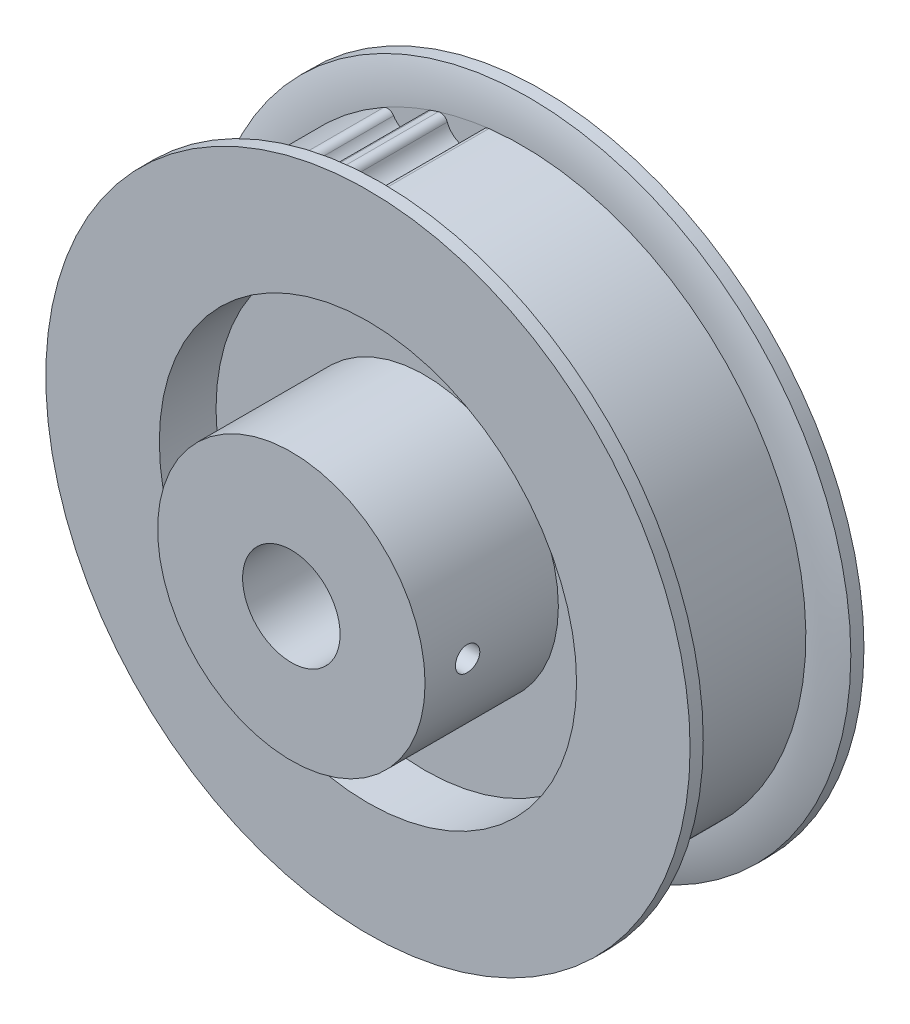
ISO-10303-21;
HEADER;
FILE_DESCRIPTION(('STEP AP214'),'2;1');
FILE_NAME('part.step','',(''),(''),'','','');
FILE_SCHEMA(('AUTOMOTIVE_DESIGN { 1 0 10303 214 1 1 1 1 }'));
ENDSEC;
DATA;
#1=APPLICATION_CONTEXT('core data for automotive mechanical design processes');
#2=APPLICATION_PROTOCOL_DEFINITION('international standard','automotive_design',2000,#1);
#3=PRODUCT_CONTEXT('',#1,'mechanical');
#4=PRODUCT('Part','Part','',(#3));
#5=PRODUCT_RELATED_PRODUCT_CATEGORY('part','',(#4));
#6=PRODUCT_DEFINITION_FORMATION('','',#4);
#7=PRODUCT_DEFINITION_CONTEXT('part definition',#1,'design');
#8=PRODUCT_DEFINITION('design','',#6,#7);
#9=PRODUCT_DEFINITION_SHAPE('','',#8);
#10=(LENGTH_UNIT() NAMED_UNIT(*) SI_UNIT(.MILLI.,.METRE.));
#11=(NAMED_UNIT(*) PLANE_ANGLE_UNIT() SI_UNIT($,.RADIAN.));
#12=(NAMED_UNIT(*) SI_UNIT($,.STERADIAN.) SOLID_ANGLE_UNIT());
#13=UNCERTAINTY_MEASURE_WITH_UNIT(LENGTH_MEASURE(1.E-05),#10,'distance_accuracy_value','');
#14=(GEOMETRIC_REPRESENTATION_CONTEXT(3) GLOBAL_UNCERTAINTY_ASSIGNED_CONTEXT((#13)) GLOBAL_UNIT_ASSIGNED_CONTEXT((#10,
#11,#12)) REPRESENTATION_CONTEXT('',''));
#15=CARTESIAN_POINT('',(0.,0.,0.));
#16=DIRECTION('',(0.,0.,1.));
#17=DIRECTION('',(1.,0.,0.));
#18=AXIS2_PLACEMENT_3D('',#15,#16,#17);
#19=CARTESIAN_POINT('',(0.,0.,-8.18));
#20=DIRECTION('',(0.,0.,1.));
#21=DIRECTION('',(1.,0.,0.));
#22=AXIS2_PLACEMENT_3D('',#19,#20,#21);
#23=CYLINDRICAL_SURFACE('',#22,4.009);
#24=CARTESIAN_POINT('',(0.,0.,-7.15));
#25=DIRECTION('',(0.,0.,1.));
#26=DIRECTION('',(1.,0.,0.));
#27=AXIS2_PLACEMENT_3D('',#24,#25,#26);
#28=CIRCLE('',#27,4.009);
#29=CARTESIAN_POINT('',(4.009,0.,-7.15));
#30=VERTEX_POINT('',#29);
#31=EDGE_CURVE('E20',#30,#30,#28,.F.);
#32=ORIENTED_EDGE('',*,*,#31,.T.);
#33=EDGE_LOOP('',(#32));
#34=FACE_BOUND('',#33,.T.);
#35=CARTESIAN_POINT('',(0.,0.,13.45));
#36=DIRECTION('',(0.,0.,1.));
#37=DIRECTION('',(1.,0.,0.));
#38=AXIS2_PLACEMENT_3D('',#35,#36,#37);
#39=CIRCLE('',#38,4.009);
#40=CARTESIAN_POINT('',(4.009,0.,13.45));
#41=VERTEX_POINT('',#40);
#42=EDGE_CURVE('E632',#41,#41,#39,.F.);
#43=ORIENTED_EDGE('',*,*,#42,.F.);
#44=EDGE_LOOP('',(#43));
#45=FACE_BOUND('',#44,.T.);
#46=CARTESIAN_POINT('',(4.009,0.,8.95));
#47=CARTESIAN_POINT('',(4.00899836550372,0.0551908520962204,8.95000282063457));
#48=CARTESIAN_POINT('',(4.00784763630519,0.110446653160701,8.95458927477763));
#49=CARTESIAN_POINT('',(4.00336384291525,0.219424046419387,8.97280195709089));
#50=CARTESIAN_POINT('',(4.00002666739113,0.273142548917412,8.98644521606377));
#51=CARTESIAN_POINT('',(3.99154021932719,0.377382395400712,9.02230722988224));
#52=CARTESIAN_POINT('',(3.98639404761028,0.42790903685331,9.04451131677123));
#53=CARTESIAN_POINT('',(3.97483915708241,0.524503614591403,9.09682153429381));
#54=CARTESIAN_POINT('',(3.96843076586231,0.570572703153768,9.12692561527033));
#55=CARTESIAN_POINT('',(3.95489840687399,0.657913993002216,9.19484073397902));
#56=CARTESIAN_POINT('',(3.9477633788263,0.69908147553429,9.23278425935317));
#57=CARTESIAN_POINT('',(3.93365522236764,0.774541554751383,9.31501931822153));
#58=CARTESIAN_POINT('',(3.92668212120812,0.808833001544661,9.35931191136136));
#59=CARTESIAN_POINT('',(3.91357717848517,0.870053064064385,9.45379240236042));
#60=CARTESIAN_POINT('',(3.90745927067669,0.896865552786396,9.50405765501213));
#61=CARTESIAN_POINT('',(3.89691749378886,0.941619508791967,9.60855890675831));
#62=CARTESIAN_POINT('',(3.89249334209781,0.959562456148547,9.66279424162416));
#63=CARTESIAN_POINT('',(3.88595285639913,0.985713549545539,9.77255259938645));
#64=CARTESIAN_POINT('',(3.88379225011952,0.994108730242365,9.82802835984838));
#65=CARTESIAN_POINT('',(3.881890961187,1.00150853719121,9.93963977605675));
#66=CARTESIAN_POINT('',(3.88214988966197,1.00051467246775,9.99577532431244));
#67=CARTESIAN_POINT('',(3.88501860770972,0.98931387699709,10.1056796612486));
#68=CARTESIAN_POINT('',(3.88757153316411,0.979329785578443,10.1594728763976));
#69=CARTESIAN_POINT('',(3.89465001309003,0.950787260078078,10.2645960028224));
#70=CARTESIAN_POINT('',(3.89917572054551,0.932228161020818,10.3159257227179));
#71=CARTESIAN_POINT('',(3.90974225148632,0.886871644677037,10.4152639110237));
#72=CARTESIAN_POINT('',(3.91579789532918,0.85999302762689,10.4632336618384));
#73=CARTESIAN_POINT('',(3.92873307577441,0.798819151386241,10.5540586700749));
#74=CARTESIAN_POINT('',(3.93561270072884,0.76452309653653,10.5969133780465));
#75=CARTESIAN_POINT('',(3.94965934057616,0.688339534501251,10.6775656283874));
#76=CARTESIAN_POINT('',(3.95682898782615,0.646265160933979,10.7151863982787));
#77=CARTESIAN_POINT('',(3.97047589904666,0.556299277081342,10.7828870581694));
#78=CARTESIAN_POINT('',(3.97695286444311,0.508405277149301,10.8129637037992));
#79=CARTESIAN_POINT('',(3.98851751482561,0.407894715285058,10.8647861073373));
#80=CARTESIAN_POINT('',(3.993599304836,0.355259325898703,10.8864966675581));
#81=CARTESIAN_POINT('',(4.00175019094036,0.246995190312301,10.9206712688926));
#82=CARTESIAN_POINT('',(4.00482347815009,0.191372941090686,10.9331545715838));
#83=CARTESIAN_POINT('',(4.00747759138432,0.112744344559036,10.9438819847958));
#84=CARTESIAN_POINT('',(4.00804709066888,0.0902637238810863,10.9461740262534));
#85=CARTESIAN_POINT('',(4.00880863009978,0.0451923663915734,10.9492336132047));
#86=CARTESIAN_POINT('',(4.00900066935511,0.0226016293202009,10.9500011550997));
#87=CARTESIAN_POINT('',(4.00899836550372,-0.0551908520962194,10.9499971793654));
#88=CARTESIAN_POINT('',(4.00784763630519,-0.1104466531607,10.9454107252224));
#89=CARTESIAN_POINT('',(4.00336384291525,-0.219424046419386,10.9271980429091));
#90=CARTESIAN_POINT('',(4.00002666739113,-0.273142548917412,10.9135547839362));
#91=CARTESIAN_POINT('',(3.99154021932719,-0.377382395400713,10.8776927701178));
#92=CARTESIAN_POINT('',(3.98639404761028,-0.42790903685331,10.8554886832288));
#93=CARTESIAN_POINT('',(3.97483915708241,-0.524503614591403,10.8031784657062));
#94=CARTESIAN_POINT('',(3.96843076586231,-0.570572703153769,10.7730743847297));
#95=CARTESIAN_POINT('',(3.95489840687399,-0.657913993002216,10.705159266021));
#96=CARTESIAN_POINT('',(3.94776337882629,-0.69908147553429,10.6672157406468));
#97=CARTESIAN_POINT('',(3.93365522236764,-0.774541554751383,10.5849806817785));
#98=CARTESIAN_POINT('',(3.92668212120812,-0.808833001544661,10.5406880886386));
#99=CARTESIAN_POINT('',(3.91357717848517,-0.870053064064385,10.4462075976396));
#100=CARTESIAN_POINT('',(3.90745927067669,-0.896865552786396,10.3959423449879));
#101=CARTESIAN_POINT('',(3.89691749378886,-0.941619508791967,10.2914410932417));
#102=CARTESIAN_POINT('',(3.89249334209781,-0.959562456148547,10.2372057583758));
#103=CARTESIAN_POINT('',(3.88595285639913,-0.985713549545539,10.1274474006135));
#104=CARTESIAN_POINT('',(3.88379225011952,-0.994108730242365,10.0719716401516));
#105=CARTESIAN_POINT('',(3.881890961187,-1.00150853719121,9.96036022394325));
#106=CARTESIAN_POINT('',(3.88214988966197,-1.00051467246775,9.90422467568755));
#107=CARTESIAN_POINT('',(3.88501860770972,-0.98931387699709,9.79432033875136));
#108=CARTESIAN_POINT('',(3.88757153316411,-0.979329785578443,9.74052712360237));
#109=CARTESIAN_POINT('',(3.89465001309003,-0.950787260078079,9.63540399717764));
#110=CARTESIAN_POINT('',(3.89917572054551,-0.932228161020818,9.5840742772821));
#111=CARTESIAN_POINT('',(3.90974225148632,-0.886871644677037,9.48473608897632));
#112=CARTESIAN_POINT('',(3.91579789532918,-0.85999302762689,9.43676633816164));
#113=CARTESIAN_POINT('',(3.92873307577441,-0.798819151386241,9.34594132992514));
#114=CARTESIAN_POINT('',(3.93561270072884,-0.76452309653653,9.30308662195345));
#115=CARTESIAN_POINT('',(3.94965934057616,-0.688339534501251,9.22243437161262));
#116=CARTESIAN_POINT('',(3.95682898782615,-0.646265160933979,9.1848136017213));
#117=CARTESIAN_POINT('',(3.97047589904666,-0.556299277081341,9.1171129418306));
#118=CARTESIAN_POINT('',(3.97695286444311,-0.508405277149301,9.08703629620081));
#119=CARTESIAN_POINT('',(3.98851751482561,-0.407894715285058,9.03521389266268));
#120=CARTESIAN_POINT('',(3.993599304836,-0.355259325898703,9.01350333244194));
#121=CARTESIAN_POINT('',(4.00175019094036,-0.2469951903123,8.97932873110735));
#122=CARTESIAN_POINT('',(4.00482347815009,-0.191372941090686,8.9668454284162));
#123=CARTESIAN_POINT('',(4.00747759138432,-0.112744344559035,8.95611801520423));
#124=CARTESIAN_POINT('',(4.00804709066888,-0.0902637238810862,8.95382597374655));
#125=CARTESIAN_POINT('',(4.00880863009978,-0.045192366391573,8.95076638679526));
#126=CARTESIAN_POINT('',(4.00900066935511,-0.0226016293202004,8.94999884490029));
#127=CARTESIAN_POINT('',(4.009,0.,8.95));
#128=B_SPLINE_CURVE_WITH_KNOTS('',3,(#46,#47,#48,#49,#50,#51,#52,#53,#54,#55,#56,#57,#58,#59,
#60,#61,#62,#63,#64,#65,#66,#67,#68,#69,#70,#71,#72,#73,#74,#75,#76,#77,#78,#79,#80,#81,#82,#83,
#84,#85,#86,#87,#88,#89,#90,#91,#92,#93,#94,#95,#96,#97,#98,#99,#100,#101,#102,#103,#104,#105,
#106,#107,#108,#109,#110,#111,#112,#113,#114,#115,#116,#117,#118,#119,#120,#121,#122,#123,#124,
#125,#126,#127),.UNSPECIFIED.,.T.,.F.,(4,2,2,2,2,2,2,2,2,2,2,2,2,2,2,2,2,2,2,2,2,2,2,2,2,2,2,2,
2,2,2,2,2,2,2,2,2,2,2,2,4),(0.,0.165485896917088,0.331283865439816,0.496799012380493,
0.662271258724692,0.830810064734122,0.999377032325899,1.17043166524782,1.34145774439516,
1.50907248457797,1.67666028587218,1.84020510988955,2.00376261862636,2.16896968634219,
2.33419448440937,2.50408040408395,2.67403925884377,2.84470555242833,3.01501457213325,
3.08278381157733,3.15055321099374,3.31603910791083,3.48183707643356,3.64735222337424,
3.81282446971844,3.98136327572787,4.14993024331964,4.32098487624157,4.49201095538891,
4.65962569557172,4.82721349686592,4.99075832088329,5.1543158296201,5.31952289733593,
5.48474769540311,5.65463361507769,5.82459246983751,5.99525876342207,6.16556778312699,
6.23333702257108,6.30110642198749),.UNSPECIFIED.);
#129=CARTESIAN_POINT('',(4.009,0.,8.95));
#130=VERTEX_POINT('',#129);
#131=EDGE_CURVE('E635',#130,#130,#128,.T.);
#132=ORIENTED_EDGE('',*,*,#131,.T.);
#133=EDGE_LOOP('',(#132));
#134=FACE_BOUND('',#133,.T.);
#135=ADVANCED_FACE('F16',(#34,#45,#134),#23,.F.);
#136=CARTESIAN_POINT('',(0.,0.,-7.15));
#137=DIRECTION('',(0.,0.,1.));
#138=DIRECTION('',(1.,0.,0.));
#139=AXIS2_PLACEMENT_3D('',#136,#137,#138);
#140=PLANE('',#139);
#141=ORIENTED_EDGE('',*,*,#31,.F.);
#142=EDGE_LOOP('',(#141));
#143=FACE_BOUND('',#142,.T.);
#144=CARTESIAN_POINT('',(0.,0.,-7.15));
#145=DIRECTION('',(0.,0.,-1.));
#146=DIRECTION('',(-1.,0.,0.));
#147=AXIS2_PLACEMENT_3D('',#144,#145,#146);
#148=CIRCLE('',#147,11.);
#149=CARTESIAN_POINT('',(-11.,0.,-7.15));
#150=VERTEX_POINT('',#149);
#151=EDGE_CURVE('E637',#150,#150,#148,.F.);
#152=ORIENTED_EDGE('',*,*,#151,.F.);
#153=EDGE_LOOP('',(#152));
#154=FACE_BOUND('',#153,.T.);
#155=ADVANCED_FACE('F606',(#143,#154),#140,.F.);
#156=CARTESIAN_POINT('',(0.,0.,13.45));
#157=DIRECTION('',(0.,0.,1.));
#158=DIRECTION('',(1.,0.,0.));
#159=AXIS2_PLACEMENT_3D('',#156,#157,#158);
#160=PLANE('',#159);
#161=ORIENTED_EDGE('',*,*,#42,.T.);
#162=EDGE_LOOP('',(#161));
#163=FACE_BOUND('',#162,.T.);
#164=CARTESIAN_POINT('',(0.,0.,13.45));
#165=DIRECTION('',(0.,0.,1.));
#166=DIRECTION('',(1.,0.,0.));
#167=AXIS2_PLACEMENT_3D('',#164,#165,#166);
#168=CIRCLE('',#167,11.);
#169=CARTESIAN_POINT('',(11.,0.,13.45));
#170=VERTEX_POINT('',#169);
#171=EDGE_CURVE('E170',#170,#170,#168,.F.);
#172=ORIENTED_EDGE('',*,*,#171,.F.);
#173=EDGE_LOOP('',(#172));
#174=FACE_BOUND('',#173,.T.);
#175=ADVANCED_FACE('F190',(#163,#174),#160,.T.);
#176=CARTESIAN_POINT('',(11.22,0.,9.95));
#177=DIRECTION('',(1.,0.,0.));
#178=DIRECTION('',(0.,0.,-1.));
#179=AXIS2_PLACEMENT_3D('',#176,#177,#178);
#180=CYLINDRICAL_SURFACE('',#179,1.);
#181=CARTESIAN_POINT('',(11.,0.,10.95));
#182=CARTESIAN_POINT('',(10.9999990618008,0.0560126496093699,10.9499954665977));
#183=CARTESIAN_POINT('',(10.9995674396925,0.112073076375414,10.9452765202687));
#184=CARTESIAN_POINT('',(10.9978854109122,0.22269272089498,10.9265074170835));
#185=CARTESIAN_POINT('',(10.9966332781448,0.27724852069916,10.9124375880333));
#186=CARTESIAN_POINT('',(10.9934520079359,0.383167343740302,10.8753788469874));
#187=CARTESIAN_POINT('',(10.9915235202305,0.434533375663347,10.8523984926046));
#188=CARTESIAN_POINT('',(10.9872059055,0.532654727732325,10.7981863161292));
#189=CARTESIAN_POINT('',(10.9848169825437,0.579412076661264,10.7669581472756));
#190=CARTESIAN_POINT('',(10.9798377834024,0.667159640349694,10.6970300166551));
#191=CARTESIAN_POINT('',(10.977246969719,0.708133582881213,10.6583096721271));
#192=CARTESIAN_POINT('',(10.9721603715182,0.783012745771742,10.5745378910209));
#193=CARTESIAN_POINT('',(10.9696645958948,0.816917305862443,10.5294858637316));
#194=CARTESIAN_POINT('',(10.9650454017585,0.876746572648426,10.4342352818317));
#195=CARTESIAN_POINT('',(10.9629226324356,0.902657424950131,10.3840279907569));
#196=CARTESIAN_POINT('',(10.9592959445208,0.945674976835949,10.2799532475713));
#197=CARTESIAN_POINT('',(10.9577920077249,0.962781935404025,10.226085903181));
#198=CARTESIAN_POINT('',(10.9555777627597,0.98766039750914,10.1163784801521));
#199=CARTESIAN_POINT('',(10.9548652607577,0.995457711611925,10.0605442996159));
#200=CARTESIAN_POINT('',(10.9543076846573,1.00157530119824,9.94835540539441));
#201=CARTESIAN_POINT('',(10.954462593006,0.999895768455735,9.89200070226554));
#202=CARTESIAN_POINT('',(10.9556203342546,0.987128672050157,9.78054842312713));
#203=CARTESIAN_POINT('',(10.9566206260902,0.97606930206751,9.72544758737241));
#204=CARTESIAN_POINT('',(10.9593524632972,0.944900127391512,9.61788693759937));
#205=CARTESIAN_POINT('',(10.9610840237171,0.924790136447161,9.56542717795595));
#206=CARTESIAN_POINT('',(10.9650862905048,0.876058370248382,9.46454715380261));
#207=CARTESIAN_POINT('',(10.9673578116427,0.847423715116364,9.41613314477831));
#208=CARTESIAN_POINT('',(10.9721830913417,0.782467376907266,9.32479178079966));
#209=CARTESIAN_POINT('',(10.9747368332432,0.746146147460724,9.28186410230395));
#210=CARTESIAN_POINT('',(10.9798498086414,0.6666968652717,9.20255309915511));
#211=CARTESIAN_POINT('',(10.9824090307129,0.623545774606622,9.16619284958842));
#212=CARTESIAN_POINT('',(10.987237477847,0.53171708951518,9.10121175815296));
#213=CARTESIAN_POINT('',(10.989506567755,0.483036939237752,9.07259451639277));
#214=CARTESIAN_POINT('',(10.993499986054,0.381499269945504,9.02391521489337));
#215=CARTESIAN_POINT('',(10.9952237910858,0.328637798187842,9.00386136779679));
#216=CARTESIAN_POINT('',(10.9979250337978,0.22036568686475,8.9729654187011));
#217=CARTESIAN_POINT('',(10.9989040550467,0.164960722962615,8.9621037665736));
#218=CARTESIAN_POINT('',(10.9998189347927,0.0728606203928066,8.95198946547373));
#219=CARTESIAN_POINT('',(11.0000006103688,0.0364404209806223,8.94999705068248));
#220=CARTESIAN_POINT('',(10.9999990618008,-0.0560126496093706,8.9500045334023));
#221=CARTESIAN_POINT('',(10.9995674396925,-0.112073076375414,8.95472347973131));
#222=CARTESIAN_POINT('',(10.9978854109122,-0.22269272089498,8.97349258291645));
#223=CARTESIAN_POINT('',(10.9966332781448,-0.277248520699161,8.98756241196671));
#224=CARTESIAN_POINT('',(10.9934520079359,-0.383167343740302,9.02462115301262));
#225=CARTESIAN_POINT('',(10.9915235202305,-0.434533375663347,9.04760150739537));
#226=CARTESIAN_POINT('',(10.9872059055,-0.532654727732325,9.10181368387078));
#227=CARTESIAN_POINT('',(10.9848169825437,-0.579412076661264,9.13304185272441));
#228=CARTESIAN_POINT('',(10.9798377834024,-0.667159640349695,9.20296998334489));
#229=CARTESIAN_POINT('',(10.977246969719,-0.708133582881214,9.2416903278729));
#230=CARTESIAN_POINT('',(10.9721603715182,-0.783012745771743,9.32546210897908));
#231=CARTESIAN_POINT('',(10.9696645958948,-0.816917305862444,9.37051413626842));
#232=CARTESIAN_POINT('',(10.9650454017585,-0.876746572648426,9.4657647181683));
#233=CARTESIAN_POINT('',(10.9629226324356,-0.902657424950131,9.51597200924306));
#234=CARTESIAN_POINT('',(10.9592959445208,-0.945674976835949,9.62004675242866));
#235=CARTESIAN_POINT('',(10.9577920077249,-0.962781935404025,9.67391409681901));
#236=CARTESIAN_POINT('',(10.9555777627597,-0.98766039750914,9.7836215198479));
#237=CARTESIAN_POINT('',(10.9548652607577,-0.995457711611925,9.83945570038413));
#238=CARTESIAN_POINT('',(10.9543076846573,-1.00157530119824,9.95164459460559));
#239=CARTESIAN_POINT('',(10.954462593006,-0.999895768455735,10.0079992977345));
#240=CARTESIAN_POINT('',(10.9556203342546,-0.987128672050157,10.1194515768729));
#241=CARTESIAN_POINT('',(10.9566206260902,-0.97606930206751,10.1745524126276));
#242=CARTESIAN_POINT('',(10.9593524632972,-0.944900127391512,10.2821130624006));
#243=CARTESIAN_POINT('',(10.9610840237171,-0.924790136447161,10.3345728220441));
#244=CARTESIAN_POINT('',(10.9650862905048,-0.876058370248382,10.4354528461974));
#245=CARTESIAN_POINT('',(10.9673578116427,-0.847423715116364,10.4838668552217));
#246=CARTESIAN_POINT('',(10.9721830913417,-0.782467376907266,10.5752082192003));
#247=CARTESIAN_POINT('',(10.9747368332432,-0.746146147460724,10.6181358976961));
#248=CARTESIAN_POINT('',(10.9798498086414,-0.6666968652717,10.6974469008449));
#249=CARTESIAN_POINT('',(10.9824090307129,-0.623545774606622,10.7338071504116));
#250=CARTESIAN_POINT('',(10.987237477847,-0.53171708951518,10.798788241847));
#251=CARTESIAN_POINT('',(10.989506567755,-0.483036939237752,10.8274054836072));
#252=CARTESIAN_POINT('',(10.993499986054,-0.381499269945504,10.8760847851066));
#253=CARTESIAN_POINT('',(10.9952237910858,-0.328637798187842,10.8961386322032));
#254=CARTESIAN_POINT('',(10.9979250337978,-0.22036568686475,10.9270345812989));
#255=CARTESIAN_POINT('',(10.9989040550467,-0.164960722962615,10.9378962334264));
#256=CARTESIAN_POINT('',(10.9998189347927,-0.0728606203928068,10.9480105345263));
#257=CARTESIAN_POINT('',(11.0000006103688,-0.0364404209806229,10.9500029493175));
#258=CARTESIAN_POINT('',(11.,0.,10.95));
#259=B_SPLINE_CURVE_WITH_KNOTS('',3,(#181,#182,#183,#184,#185,#186,#187,#188,#189,#190,#191,
#192,#193,#194,#195,#196,#197,#198,#199,#200,#201,#202,#203,#204,#205,#206,#207,#208,#209,#210,
#211,#212,#213,#214,#215,#216,#217,#218,#219,#220,#221,#222,#223,#224,#225,#226,#227,#228,#229,
#230,#231,#232,#233,#234,#235,#236,#237,#238,#239,#240,#241,#242,#243,#244,#245,#246,#247,#248,
#249,#250,#251,#252,#253,#254,#255,#256,#257,#258),.UNSPECIFIED.,.T.,.F.,(4,2,2,2,2,2,2,2,2,2,2,
2,2,2,2,2,2,2,2,2,2,2,2,2,2,2,2,2,2,2,2,2,2,2,2,2,2,2,4),(0.,0.167922295939353,
0.336198986356551,0.504314463591334,0.672355601251542,0.840860497837456,1.00938112545174,
1.17819220678412,1.34699832192048,1.51533533490065,1.68366894141662,1.85149836085627,
2.01933123418343,2.18741898364612,2.35549681601437,2.52415417583214,2.69288981859704,
2.86178692421131,3.03032390712414,3.13956992920554,3.30749222514489,3.47576891556209,
3.64388439279687,3.81192553045708,3.980430427043,4.14895105465728,4.31776213598966,
4.48656825112601,4.65490526410619,4.82323887062216,4.99106829006181,5.15890116338897,
5.32698891285165,5.49506674521991,5.66372410503767,5.83245974780258,6.00135685341684,
6.16989383632968,6.27913985841107),.UNSPECIFIED.);
#260=CARTESIAN_POINT('',(11.,0.,10.95));
#261=VERTEX_POINT('',#260);
#262=EDGE_CURVE('E163',#261,#261,#259,.T.);
#263=ORIENTED_EDGE('',*,*,#262,.F.);
#264=EDGE_LOOP('',(#263));
#265=FACE_BOUND('',#264,.T.);
#266=ORIENTED_EDGE('',*,*,#131,.F.);
#267=EDGE_LOOP('',(#266));
#268=FACE_BOUND('',#267,.T.);
#269=ADVANCED_FACE('F172',(#265,#268),#180,.F.);
#270=CARTESIAN_POINT('',(0.,0.,7.865));
#271=DIRECTION('',(0.,0.,-1.));
#272=DIRECTION('',(-1.,0.,0.));
#273=AXIS2_PLACEMENT_3D('',#270,#271,#272);
#274=CYLINDRICAL_SURFACE('',#273,11.);
#275=CARTESIAN_POINT('',(0.,0.,-2.486));
#276=DIRECTION('',(0.,0.,-1.));
#277=DIRECTION('',(-1.,0.,0.));
#278=AXIS2_PLACEMENT_3D('',#275,#276,#277);
#279=CIRCLE('',#278,11.);
#280=CARTESIAN_POINT('',(-11.,0.,-2.486));
#281=VERTEX_POINT('',#280);
#282=EDGE_CURVE('E160',#281,#281,#279,.F.);
#283=ORIENTED_EDGE('',*,*,#282,.F.);
#284=EDGE_LOOP('',(#283));
#285=FACE_BOUND('',#284,.T.);
#286=ORIENTED_EDGE('',*,*,#151,.T.);
#287=EDGE_LOOP('',(#286));
#288=FACE_BOUND('',#287,.T.);
#289=ADVANCED_FACE('F181',(#285,#288),#274,.T.);
#290=CARTESIAN_POINT('',(0.,0.,-8.18));
#291=DIRECTION('',(0.,0.,1.));
#292=DIRECTION('',(1.,0.,0.));
#293=AXIS2_PLACEMENT_3D('',#290,#291,#292);
#294=CYLINDRICAL_SURFACE('',#293,11.);
#295=CARTESIAN_POINT('',(0.,0.,2.486));
#296=DIRECTION('',(0.,0.,1.));
#297=DIRECTION('',(1.,0.,0.));
#298=AXIS2_PLACEMENT_3D('',#295,#296,#297);
#299=CIRCLE('',#298,11.);
#300=CARTESIAN_POINT('',(11.,0.,2.486));
#301=VERTEX_POINT('',#300);
#302=EDGE_CURVE('E156',#301,#301,#299,.T.);
#303=ORIENTED_EDGE('',*,*,#302,.T.);
#304=EDGE_LOOP('',(#303));
#305=FACE_BOUND('',#304,.T.);
#306=ORIENTED_EDGE('',*,*,#171,.T.);
#307=EDGE_LOOP('',(#306));
#308=FACE_BOUND('',#307,.T.);
#309=ORIENTED_EDGE('',*,*,#262,.T.);
#310=EDGE_LOOP('',(#309));
#311=FACE_BOUND('',#310,.T.);
#312=ADVANCED_FACE('F176',(#305,#308,#311),#294,.T.);
#313=CARTESIAN_POINT('',(0.,0.,-2.486));
#314=DIRECTION('',(0.,0.,-1.));
#315=DIRECTION('',(-1.,0.,0.));
#316=AXIS2_PLACEMENT_3D('',#313,#314,#315);
#317=PLANE('',#316);
#318=ORIENTED_EDGE('',*,*,#282,.T.);
#319=EDGE_LOOP('',(#318));
#320=FACE_BOUND('',#319,.T.);
#321=CARTESIAN_POINT('',(0.,0.,-2.486));
#322=DIRECTION('',(0.,0.,-1.));
#323=DIRECTION('',(-1.,0.,0.));
#324=AXIS2_PLACEMENT_3D('',#321,#322,#323);
#325=CIRCLE('',#324,17.16);
#326=CARTESIAN_POINT('',(-17.16,0.,-2.486));
#327=VERTEX_POINT('',#326);
#328=EDGE_CURVE('E152',#327,#327,#325,.T.);
#329=ORIENTED_EDGE('',*,*,#328,.T.);
#330=EDGE_LOOP('',(#329));
#331=FACE_BOUND('',#330,.T.);
#332=ADVANCED_FACE('F180',(#320,#331),#317,.T.);
#333=CARTESIAN_POINT('',(0.,0.,2.486));
#334=DIRECTION('',(0.,0.,-1.));
#335=DIRECTION('',(-1.,0.,0.));
#336=AXIS2_PLACEMENT_3D('',#333,#334,#335);
#337=PLANE('',#336);
#338=ORIENTED_EDGE('',*,*,#302,.F.);
#339=EDGE_LOOP('',(#338));
#340=FACE_BOUND('',#339,.T.);
#341=CARTESIAN_POINT('',(0.,0.,2.486));
#342=DIRECTION('',(0.,0.,-1.));
#343=DIRECTION('',(-1.,0.,0.));
#344=AXIS2_PLACEMENT_3D('',#341,#342,#343);
#345=CIRCLE('',#344,17.16);
#346=CARTESIAN_POINT('',(-17.16,0.,2.486));
#347=VERTEX_POINT('',#346);
#348=EDGE_CURVE('E147',#347,#347,#345,.F.);
#349=ORIENTED_EDGE('',*,*,#348,.T.);
#350=EDGE_LOOP('',(#349));
#351=FACE_BOUND('',#350,.T.);
#352=ADVANCED_FACE('F350',(#340,#351),#337,.F.);
#353=CARTESIAN_POINT('',(0.,0.,-8.18));
#354=DIRECTION('',(0.,0.,1.));
#355=DIRECTION('',(1.,0.,0.));
#356=AXIS2_PLACEMENT_3D('',#353,#354,#355);
#357=CYLINDRICAL_SURFACE('',#356,23.32);
#358=CARTESIAN_POINT('',(0.,0.,-5.55));
#359=DIRECTION('',(0.,0.,1.));
#360=DIRECTION('',(1.,0.,0.));
#361=AXIS2_PLACEMENT_3D('',#358,#359,#360);
#362=CIRCLE('',#361,23.32);
#363=CARTESIAN_POINT('',(-6.91016926143976,22.2726729598892,-5.55));
#364=VERTEX_POINT('',#363);
#365=CARTESIAN_POINT('',(-7.50110432864196,22.0806665173599,-5.55));
#366=VERTEX_POINT('',#365);
#367=EDGE_CURVE('E155',#364,#366,#362,.T.);
#368=ORIENTED_EDGE('',*,*,#367,.T.);
#369=DIRECTION('',(0.,0.,1.));
#370=VECTOR('',#369,1.);
#371=CARTESIAN_POINT('',(-7.50110432864213,22.0806665173604,5.55));
#372=LINE('',#371,#370);
#373=CARTESIAN_POINT('',(-7.501104328642,22.08066651736,5.55));
#374=VERTEX_POINT('',#373);
#375=EDGE_CURVE('E134',#374,#366,#372,.F.);
#376=ORIENTED_EDGE('',*,*,#375,.F.);
#377=CARTESIAN_POINT('',(0.,0.,5.55));
#378=DIRECTION('',(0.,0.,1.));
#379=DIRECTION('',(1.,0.,0.));
#380=AXIS2_PLACEMENT_3D('',#377,#378,#379);
#381=CIRCLE('',#380,23.32);
#382=CARTESIAN_POINT('',(-6.9101692614398,22.2726729598894,5.55));
#383=VERTEX_POINT('',#382);
#384=EDGE_CURVE('E159',#374,#383,#381,.F.);
#385=ORIENTED_EDGE('',*,*,#384,.T.);
#386=DIRECTION('',(0.,0.,1.));
#387=VECTOR('',#386,1.);
#388=CARTESIAN_POINT('',(-6.91016926143916,22.2726729598873,5.55));
#389=LINE('',#388,#387);
#390=EDGE_CURVE('E105',#364,#383,#389,.T.);
#391=ORIENTED_EDGE('',*,*,#390,.F.);
#392=EDGE_LOOP('',(#368,#376,#385,#391));
#393=FACE_BOUND('',#392,.T.);
#394=ADVANCED_FACE('F347',(#393),#357,.T.);
#395=CARTESIAN_POINT('',(0.,0.,7.865));
#396=DIRECTION('',(0.,0.,-1.));
#397=DIRECTION('',(-1.,0.,0.));
#398=AXIS2_PLACEMENT_3D('',#395,#396,#397);
#399=CYLINDRICAL_SURFACE('',#398,17.16);
#400=ORIENTED_EDGE('',*,*,#328,.F.);
#401=EDGE_LOOP('',(#400));
#402=FACE_BOUND('',#401,.T.);
#403=CARTESIAN_POINT('',(0.,0.,-7.15));
#404=DIRECTION('',(0.,0.,-1.));
#405=DIRECTION('',(-1.,0.,0.));
#406=AXIS2_PLACEMENT_3D('',#403,#404,#405);
#407=CIRCLE('',#406,17.16);
#408=CARTESIAN_POINT('',(-17.16,0.,-7.15));
#409=VERTEX_POINT('',#408);
#410=EDGE_CURVE('E131',#409,#409,#407,.T.);
#411=ORIENTED_EDGE('',*,*,#410,.T.);
#412=EDGE_LOOP('',(#411));
#413=FACE_BOUND('',#412,.T.);
#414=ADVANCED_FACE('F343',(#402,#413),#399,.F.);
#415=CARTESIAN_POINT('',(0.,0.,7.865));
#416=DIRECTION('',(0.,0.,-1.));
#417=DIRECTION('',(-1.,0.,0.));
#418=AXIS2_PLACEMENT_3D('',#415,#416,#417);
#419=CYLINDRICAL_SURFACE('',#418,17.16);
#420=ORIENTED_EDGE('',*,*,#348,.F.);
#421=EDGE_LOOP('',(#420));
#422=FACE_BOUND('',#421,.T.);
#423=CARTESIAN_POINT('',(0.,0.,7.15));
#424=DIRECTION('',(0.,0.,-1.));
#425=DIRECTION('',(-1.,0.,0.));
#426=AXIS2_PLACEMENT_3D('',#423,#424,#425);
#427=CIRCLE('',#426,17.16);
#428=CARTESIAN_POINT('',(-17.16,0.,7.15));
#429=VERTEX_POINT('',#428);
#430=EDGE_CURVE('E115',#429,#429,#427,.T.);
#431=ORIENTED_EDGE('',*,*,#430,.F.);
#432=EDGE_LOOP('',(#431));
#433=FACE_BOUND('',#432,.T.);
#434=ADVANCED_FACE('F340',(#422,#433),#419,.F.);
#435=CARTESIAN_POINT('',(-6.732543538129,21.70015447458,5.55));
#436=DIRECTION('',(0.,0.,1.));
#437=DIRECTION('',(1.,0.,0.));
#438=AXIS2_PLACEMENT_3D('',#435,#436,#437);
#439=CYLINDRICAL_SURFACE('',#438,0.59944);
#440=CARTESIAN_POINT('',(-6.732543538129,21.70015447458,-5.55));
#441=DIRECTION('',(0.,0.,1.));
#442=DIRECTION('',(1.,0.,0.));
#443=AXIS2_PLACEMENT_3D('',#440,#441,#442);
#444=CIRCLE('',#443,0.59944);
#445=CARTESIAN_POINT('',(-6.17049647482017,21.9085565192605,-5.55));
#446=VERTEX_POINT('',#445);
#447=EDGE_CURVE('E91',#446,#364,#444,.T.);
#448=ORIENTED_EDGE('',*,*,#447,.T.);
#449=ORIENTED_EDGE('',*,*,#390,.T.);
#450=CARTESIAN_POINT('',(-6.732543538129,21.70015447458,5.55));
#451=DIRECTION('',(0.,0.,1.));
#452=DIRECTION('',(1.,0.,0.));
#453=AXIS2_PLACEMENT_3D('',#450,#451,#452);
#454=CIRCLE('',#453,0.59944);
#455=CARTESIAN_POINT('',(-6.17049647482017,21.9085565192605,5.55));
#456=VERTEX_POINT('',#455);
#457=EDGE_CURVE('E106',#383,#456,#454,.F.);
#458=ORIENTED_EDGE('',*,*,#457,.T.);
#459=DIRECTION('',(0.,0.,1.));
#460=VECTOR('',#459,1.);
#461=CARTESIAN_POINT('',(-6.17049647481917,21.9085565192603,5.55));
#462=LINE('',#461,#460);
#463=EDGE_CURVE('E110',#456,#446,#462,.F.);
#464=ORIENTED_EDGE('',*,*,#463,.T.);
#465=EDGE_LOOP('',(#448,#449,#458,#464));
#466=FACE_BOUND('',#465,.T.);
#467=ADVANCED_FACE('F111',(#466),#439,.T.);
#468=CARTESIAN_POINT('',(-7.308288634914,21.51308355263,5.55));
#469=DIRECTION('',(0.,0.,1.));
#470=DIRECTION('',(1.,0.,0.));
#471=AXIS2_PLACEMENT_3D('',#468,#469,#470);
#472=CYLINDRICAL_SURFACE('',#471,0.59944);
#473=CARTESIAN_POINT('',(-7.308288634914,21.51308355263,5.55));
#474=DIRECTION('',(0.,0.,1.));
#475=DIRECTION('',(1.,0.,0.));
#476=AXIS2_PLACEMENT_3D('',#473,#474,#475);
#477=CIRCLE('',#476,0.59944);
#478=CARTESIAN_POINT('',(-7.88548990917935,21.35132137353,5.55));
#479=VERTEX_POINT('',#478);
#480=EDGE_CURVE('E135',#479,#374,#477,.F.);
#481=ORIENTED_EDGE('',*,*,#480,.T.);
#482=ORIENTED_EDGE('',*,*,#375,.T.);
#483=CARTESIAN_POINT('',(-7.308288634914,21.51308355263,-5.55));
#484=DIRECTION('',(0.,0.,1.));
#485=DIRECTION('',(1.,0.,0.));
#486=AXIS2_PLACEMENT_3D('',#483,#484,#485);
#487=CIRCLE('',#486,0.59944);
#488=CARTESIAN_POINT('',(-7.88548990917935,21.35132137353,-5.55));
#489=VERTEX_POINT('',#488);
#490=EDGE_CURVE('E138',#366,#489,#487,.T.);
#491=ORIENTED_EDGE('',*,*,#490,.T.);
#492=DIRECTION('',(0.,0.,1.));
#493=VECTOR('',#492,1.);
#494=CARTESIAN_POINT('',(-7.8854899091799,21.3513213735297,5.55));
#495=LINE('',#494,#493);
#496=EDGE_CURVE('E114',#489,#479,#495,.T.);
#497=ORIENTED_EDGE('',*,*,#496,.T.);
#498=EDGE_LOOP('',(#481,#482,#491,#497));
#499=FACE_BOUND('',#498,.T.);
#500=ADVANCED_FACE('F324',(#499),#472,.T.);
#501=CARTESIAN_POINT('',(0.,0.,-7.15));
#502=DIRECTION('',(0.,0.,1.));
#503=DIRECTION('',(1.,0.,0.));
#504=AXIS2_PLACEMENT_3D('',#501,#502,#503);
#505=PLANE('',#504);
#506=ORIENTED_EDGE('',*,*,#410,.F.);
#507=EDGE_LOOP('',(#506));
#508=FACE_BOUND('',#507,.T.);
#509=CARTESIAN_POINT('',(0.,0.,-7.15));
#510=DIRECTION('',(0.,0.,1.));
#511=DIRECTION('',(1.,0.,0.));
#512=AXIS2_PLACEMENT_3D('',#509,#510,#511);
#513=CIRCLE('',#512,26.5);
#514=CARTESIAN_POINT('',(26.5,0.,-7.15));
#515=VERTEX_POINT('',#514);
#516=EDGE_CURVE('E122',#515,#515,#513,.T.);
#517=ORIENTED_EDGE('',*,*,#516,.F.);
#518=EDGE_LOOP('',(#517));
#519=FACE_BOUND('',#518,.T.);
#520=ADVANCED_FACE('F321',(#508,#519),#505,.F.);
#521=CARTESIAN_POINT('',(0.,0.,7.15));
#522=DIRECTION('',(0.,0.,1.));
#523=DIRECTION('',(1.,0.,0.));
#524=AXIS2_PLACEMENT_3D('',#521,#522,#523);
#525=PLANE('',#524);
#526=ORIENTED_EDGE('',*,*,#430,.T.);
#527=EDGE_LOOP('',(#526));
#528=FACE_BOUND('',#527,.T.);
#529=CARTESIAN_POINT('',(0.,0.,7.15));
#530=DIRECTION('',(0.,0.,1.));
#531=DIRECTION('',(1.,0.,0.));
#532=AXIS2_PLACEMENT_3D('',#529,#530,#531);
#533=CIRCLE('',#532,26.5);
#534=CARTESIAN_POINT('',(26.5,0.,7.15));
#535=VERTEX_POINT('',#534);
#536=EDGE_CURVE('E305',#535,#535,#533,.F.);
#537=ORIENTED_EDGE('',*,*,#536,.F.);
#538=EDGE_LOOP('',(#537));
#539=FACE_BOUND('',#538,.T.);
#540=ADVANCED_FACE('F323',(#528,#539),#525,.T.);
#541=CARTESIAN_POINT('',(-4.577235943663,22.49932333236,5.55));
#542=DIRECTION('',(0.,0.,1.));
#543=DIRECTION('',(1.,0.,0.));
#544=AXIS2_PLACEMENT_3D('',#541,#542,#543);
#545=CYLINDRICAL_SURFACE('',#544,1.69926);
#546=CARTESIAN_POINT('',(-4.577235943663,22.49932333236,-5.55));
#547=DIRECTION('',(0.,0.,1.));
#548=DIRECTION('',(1.,0.,0.));
#549=AXIS2_PLACEMENT_3D('',#546,#547,#548);
#550=CIRCLE('',#549,1.69926);
#551=CARTESIAN_POINT('',(-4.42268693160831,20.8071061032567,-5.55));
#552=VERTEX_POINT('',#551);
#553=EDGE_CURVE('E97',#446,#552,#550,.T.);
#554=ORIENTED_EDGE('',*,*,#553,.F.);
#555=ORIENTED_EDGE('',*,*,#463,.F.);
#556=CARTESIAN_POINT('',(-4.577235943663,22.49932333236,5.55));
#557=DIRECTION('',(0.,0.,1.));
#558=DIRECTION('',(1.,0.,0.));
#559=AXIS2_PLACEMENT_3D('',#556,#557,#558);
#560=CIRCLE('',#559,1.69926);
#561=CARTESIAN_POINT('',(-4.42268693160831,20.8071061032567,5.55));
#562=VERTEX_POINT('',#561);
#563=EDGE_CURVE('E303',#456,#562,#560,.T.);
#564=ORIENTED_EDGE('',*,*,#563,.T.);
#565=DIRECTION('',(0.,0.,1.));
#566=VECTOR('',#565,1.);
#567=CARTESIAN_POINT('',(-4.42268693160971,20.8071061032562,5.55));
#568=LINE('',#567,#566);
#569=EDGE_CURVE('E119',#562,#552,#568,.F.);
#570=ORIENTED_EDGE('',*,*,#569,.T.);
#571=EDGE_LOOP('',(#554,#555,#564,#570));
#572=FACE_BOUND('',#571,.T.);
#573=ADVANCED_FACE('F117',(#572),#545,.F.);
#574=CARTESIAN_POINT('',(-9.521708775634,20.89276672176,5.55));
#575=DIRECTION('',(0.,0.,1.));
#576=DIRECTION('',(1.,0.,0.));
#577=AXIS2_PLACEMENT_3D('',#574,#575,#576);
#578=CYLINDRICAL_SURFACE('',#577,1.69926);
#579=CARTESIAN_POINT('',(-9.521708775634,20.89276672176,-5.55));
#580=DIRECTION('',(0.,0.,1.));
#581=DIRECTION('',(1.,0.,0.));
#582=AXIS2_PLACEMENT_3D('',#579,#580,#581);
#583=CIRCLE('',#582,1.69926);
#584=CARTESIAN_POINT('',(-8.65208122190394,19.4328925952025,-5.55));
#585=VERTEX_POINT('',#584);
#586=EDGE_CURVE('E254',#585,#489,#583,.T.);
#587=ORIENTED_EDGE('',*,*,#586,.F.);
#588=DIRECTION('',(0.,0.,1.));
#589=VECTOR('',#588,1.);
#590=CARTESIAN_POINT('',(-8.65208122190561,19.432892595202,5.55));
#591=LINE('',#590,#589);
#592=CARTESIAN_POINT('',(-8.65208122190394,19.4328925952025,5.55));
#593=VERTEX_POINT('',#592);
#594=EDGE_CURVE('E249',#585,#593,#591,.T.);
#595=ORIENTED_EDGE('',*,*,#594,.T.);
#596=CARTESIAN_POINT('',(-9.521708775634,20.89276672176,5.55));
#597=DIRECTION('',(0.,0.,1.));
#598=DIRECTION('',(1.,0.,0.));
#599=AXIS2_PLACEMENT_3D('',#596,#597,#598);
#600=CIRCLE('',#599,1.69926);
#601=EDGE_CURVE('E294',#593,#479,#600,.T.);
#602=ORIENTED_EDGE('',*,*,#601,.T.);
#603=ORIENTED_EDGE('',*,*,#496,.F.);
#604=EDGE_LOOP('',(#587,#595,#602,#603));
#605=FACE_BOUND('',#604,.T.);
#606=ADVANCED_FACE('F384',(#605),#578,.F.);
#607=CARTESIAN_POINT('',(0.,0.,-5.55));
#608=DIRECTION('',(0.,0.,1.));
#609=DIRECTION('',(1.,0.,0.));
#610=AXIS2_PLACEMENT_3D('',#607,#608,#609);
#611=PLANE('',#610);
#612=CARTESIAN_POINT('',(-2.67576341758,22.56244970846,-5.55));
#613=DIRECTION('',(0.,0.,1.));
#614=DIRECTION('',(1.,0.,0.));
#615=AXIS2_PLACEMENT_3D('',#612,#613,#614);
#616=CIRCLE('',#615,0.59944);
#617=CARTESIAN_POINT('',(-3.27398370730967,22.5242293139598,-5.55));
#618=VERTEX_POINT('',#617);
#619=CARTESIAN_POINT('',(-2.74635849170109,23.1577182605508,-5.55));
#620=VERTEX_POINT('',#619);
#621=EDGE_CURVE('E120',#618,#620,#616,.F.);
#622=ORIENTED_EDGE('',*,*,#621,.T.);
#623=CARTESIAN_POINT('',(0.,0.,-5.55));
#624=DIRECTION('',(0.,0.,-1.));
#625=DIRECTION('',(-0.296319436596922,0.955088891933564,0.));
#626=AXIS2_PLACEMENT_3D('',#623,#624,#625);
#627=CIRCLE('',#626,23.3199999999993);
#628=EDGE_CURVE('E100',#364,#620,#627,.T.);
#629=ORIENTED_EDGE('',*,*,#628,.F.);
#630=ORIENTED_EDGE('',*,*,#447,.F.);
#631=ORIENTED_EDGE('',*,*,#553,.T.);
#632=CARTESIAN_POINT('',(-4.969786138789,22.4158842126,-5.55));
#633=DIRECTION('',(0.,0.,1.));
#634=DIRECTION('',(1.,0.,0.));
#635=AXIS2_PLACEMENT_3D('',#632,#633,#634);
#636=CIRCLE('',#635,1.69926);
#637=EDGE_CURVE('E253',#552,#618,#636,.T.);
#638=ORIENTED_EDGE('',*,*,#637,.T.);
#639=EDGE_LOOP('',(#622,#629,#630,#631,#638));
#640=FACE_BOUND('',#639,.T.);
#641=ADVANCED_FACE('F94',(#640),#611,.T.);
#642=CARTESIAN_POINT('',(0.,0.,-8.18));
#643=DIRECTION('',(0.,0.,1.));
#644=DIRECTION('',(1.,0.,0.));
#645=AXIS2_PLACEMENT_3D('',#642,#643,#644);
#646=CYLINDRICAL_SURFACE('',#645,26.5);
#647=ORIENTED_EDGE('',*,*,#516,.T.);
#648=EDGE_LOOP('',(#647));
#649=FACE_BOUND('',#648,.T.);
#650=CARTESIAN_POINT('',(0.,0.,-6.06909287040525));
#651=DIRECTION('',(0.,0.,-1.));
#652=DIRECTION('',(0.,-1.,0.));
#653=AXIS2_PLACEMENT_3D('',#650,#651,#652);
#654=CIRCLE('',#653,26.4999999999999);
#655=CARTESIAN_POINT('',(0.,-26.4999999999999,-6.06909287040525));
#656=VERTEX_POINT('',#655);
#657=EDGE_CURVE('E263',#656,#656,#654,.F.);
#658=ORIENTED_EDGE('',*,*,#657,.F.);
#659=EDGE_LOOP('',(#658));
#660=FACE_BOUND('',#659,.T.);
#661=ADVANCED_FACE('F318',(#649,#660),#646,.T.);
#662=CARTESIAN_POINT('',(0.,0.,-5.55));
#663=DIRECTION('',(0.,0.,1.));
#664=DIRECTION('',(1.,0.,0.));
#665=AXIS2_PLACEMENT_3D('',#662,#663,#664);
#666=PLANE('',#665);
#667=ORIENTED_EDGE('',*,*,#490,.F.);
#668=CARTESIAN_POINT('',(0.,0.,-5.55));
#669=DIRECTION('',(0.,0.,-1.));
#670=DIRECTION('',(-0.488418292358468,0.872609633048844,0.));
#671=AXIS2_PLACEMENT_3D('',#668,#669,#670);
#672=CIRCLE('',#671,23.3199999999999);
#673=CARTESIAN_POINT('',(-11.3899145777994,20.349256642699,-5.55));
#674=VERTEX_POINT('',#673);
#675=EDGE_CURVE('E266',#674,#366,#672,.T.);
#676=ORIENTED_EDGE('',*,*,#675,.F.);
#677=CARTESIAN_POINT('',(-11.09713711647,19.82617952435,-5.55));
#678=DIRECTION('',(0.,0.,1.));
#679=DIRECTION('',(1.,0.,0.));
#680=AXIS2_PLACEMENT_3D('',#677,#678,#679);
#681=CIRCLE('',#680,0.59944);
#682=CARTESIAN_POINT('',(-10.5907013514749,20.1468836395931,-5.55));
#683=VERTEX_POINT('',#682);
#684=EDGE_CURVE('E311',#674,#683,#681,.F.);
#685=ORIENTED_EDGE('',*,*,#684,.T.);
#686=CARTESIAN_POINT('',(-9.155084712573,21.05599827136,-5.55));
#687=DIRECTION('',(0.,0.,1.));
#688=DIRECTION('',(1.,0.,0.));
#689=AXIS2_PLACEMENT_3D('',#686,#687,#688);
#690=CIRCLE('',#689,1.69926);
#691=EDGE_CURVE('E251',#683,#585,#690,.T.);
#692=ORIENTED_EDGE('',*,*,#691,.T.);
#693=ORIENTED_EDGE('',*,*,#586,.T.);
#694=EDGE_LOOP('',(#667,#676,#685,#692,#693));
#695=FACE_BOUND('',#694,.T.);
#696=ADVANCED_FACE('F413',(#695),#666,.T.);
#697=CARTESIAN_POINT('',(-4.969786138789,22.4158842126,5.55));
#698=DIRECTION('',(0.,0.,1.));
#699=DIRECTION('',(1.,0.,0.));
#700=AXIS2_PLACEMENT_3D('',#697,#698,#699);
#701=CYLINDRICAL_SURFACE('',#700,1.69926);
#702=ORIENTED_EDGE('',*,*,#637,.F.);
#703=ORIENTED_EDGE('',*,*,#569,.F.);
#704=CARTESIAN_POINT('',(-4.969786138789,22.4158842126,5.55));
#705=DIRECTION('',(0.,0.,1.));
#706=DIRECTION('',(1.,0.,0.));
#707=AXIS2_PLACEMENT_3D('',#704,#705,#706);
#708=CIRCLE('',#707,1.69926);
#709=CARTESIAN_POINT('',(-3.27398370730965,22.5242293139598,5.55));
#710=VERTEX_POINT('',#709);
#711=EDGE_CURVE('E299',#562,#710,#708,.T.);
#712=ORIENTED_EDGE('',*,*,#711,.T.);
#713=DIRECTION('',(0.,0.,1.));
#714=VECTOR('',#713,1.);
#715=CARTESIAN_POINT('',(-3.27398370730968,22.52422931396,5.55));
#716=LINE('',#715,#714);
#717=EDGE_CURVE('E286',#618,#710,#716,.T.);
#718=ORIENTED_EDGE('',*,*,#717,.F.);
#719=EDGE_LOOP('',(#702,#703,#712,#718));
#720=FACE_BOUND('',#719,.T.);
#721=ADVANCED_FACE('F370',(#720),#701,.F.);
#722=CARTESIAN_POINT('',(0.,0.,-8.18));
#723=DIRECTION('',(0.,0.,1.));
#724=DIRECTION('',(1.,0.,0.));
#725=AXIS2_PLACEMENT_3D('',#722,#723,#724);
#726=CYLINDRICAL_SURFACE('',#725,26.5);
#727=ORIENTED_EDGE('',*,*,#536,.T.);
#728=EDGE_LOOP('',(#727));
#729=FACE_BOUND('',#728,.T.);
#730=CARTESIAN_POINT('',(0.,0.,6.06909287040525));
#731=DIRECTION('',(0.,0.,-1.));
#732=DIRECTION('',(0.,-1.,0.));
#733=AXIS2_PLACEMENT_3D('',#730,#731,#732);
#734=CIRCLE('',#733,26.4999999999999);
#735=CARTESIAN_POINT('',(0.,-26.4999999999999,6.06909287040525));
#736=VERTEX_POINT('',#735);
#737=EDGE_CURVE('E256',#736,#736,#734,.T.);
#738=ORIENTED_EDGE('',*,*,#737,.F.);
#739=EDGE_LOOP('',(#738));
#740=FACE_BOUND('',#739,.T.);
#741=ADVANCED_FACE('F366',(#729,#740),#726,.T.);
#742=CARTESIAN_POINT('',(0.,0.,5.55));
#743=DIRECTION('',(0.,0.,1.));
#744=DIRECTION('',(1.,0.,0.));
#745=AXIS2_PLACEMENT_3D('',#742,#743,#744);
#746=PLANE('',#745);
#747=ORIENTED_EDGE('',*,*,#711,.F.);
#748=ORIENTED_EDGE('',*,*,#563,.F.);
#749=ORIENTED_EDGE('',*,*,#457,.F.);
#750=CARTESIAN_POINT('',(0.,0.,5.55));
#751=DIRECTION('',(0.,0.,1.));
#752=DIRECTION('',(-0.117768374429722,0.993041091790355,0.));
#753=AXIS2_PLACEMENT_3D('',#750,#751,#752);
#754=CIRCLE('',#753,23.3200000000002);
#755=CARTESIAN_POINT('',(-2.74635849170111,23.1577182605509,5.55));
#756=VERTEX_POINT('',#755);
#757=EDGE_CURVE('E259',#756,#383,#754,.T.);
#758=ORIENTED_EDGE('',*,*,#757,.F.);
#759=CARTESIAN_POINT('',(-2.67576341758,22.56244970846,5.55));
#760=DIRECTION('',(0.,0.,1.));
#761=DIRECTION('',(1.,0.,0.));
#762=AXIS2_PLACEMENT_3D('',#759,#760,#761);
#763=CIRCLE('',#762,0.59944);
#764=EDGE_CURVE('E260',#710,#756,#763,.F.);
#765=ORIENTED_EDGE('',*,*,#764,.F.);
#766=EDGE_LOOP('',(#747,#748,#749,#758,#765));
#767=FACE_BOUND('',#766,.T.);
#768=ADVANCED_FACE('F369',(#767),#746,.F.);
#769=CARTESIAN_POINT('',(0.,0.,5.55));
#770=DIRECTION('',(0.,0.,1.));
#771=DIRECTION('',(1.,0.,0.));
#772=AXIS2_PLACEMENT_3D('',#769,#770,#771);
#773=PLANE('',#772);
#774=ORIENTED_EDGE('',*,*,#601,.F.);
#775=CARTESIAN_POINT('',(-9.155084712573,21.05599827136,5.55));
#776=DIRECTION('',(0.,0.,1.));
#777=DIRECTION('',(1.,0.,0.));
#778=AXIS2_PLACEMENT_3D('',#775,#776,#777);
#779=CIRCLE('',#778,1.69926);
#780=CARTESIAN_POINT('',(-10.5907013514749,20.1468836395931,5.55));
#781=VERTEX_POINT('',#780);
#782=EDGE_CURVE('E291',#593,#781,#779,.F.);
#783=ORIENTED_EDGE('',*,*,#782,.T.);
#784=CARTESIAN_POINT('',(-11.09713711647,19.82617952435,5.55));
#785=DIRECTION('',(0.,0.,1.));
#786=DIRECTION('',(1.,0.,0.));
#787=AXIS2_PLACEMENT_3D('',#784,#785,#786);
#788=CIRCLE('',#787,0.59944);
#789=CARTESIAN_POINT('',(-11.3899145777995,20.3492566426991,5.55));
#790=VERTEX_POINT('',#789);
#791=EDGE_CURVE('E297',#790,#781,#788,.F.);
#792=ORIENTED_EDGE('',*,*,#791,.F.);
#793=CARTESIAN_POINT('',(0.,0.,5.55));
#794=DIRECTION('',(0.,0.,1.));
#795=DIRECTION('',(-0.321659705344844,0.946855339509404,0.));
#796=AXIS2_PLACEMENT_3D('',#793,#794,#795);
#797=CIRCLE('',#796,23.3200000000007);
#798=EDGE_CURVE('E248',#374,#790,#797,.T.);
#799=ORIENTED_EDGE('',*,*,#798,.F.);
#800=ORIENTED_EDGE('',*,*,#480,.F.);
#801=EDGE_LOOP('',(#774,#783,#792,#799,#800));
#802=FACE_BOUND('',#801,.T.);
#803=ADVANCED_FACE('F381',(#802),#773,.F.);
#804=CARTESIAN_POINT('',(-9.155084712573,21.05599827136,5.55));
#805=DIRECTION('',(0.,0.,1.));
#806=DIRECTION('',(1.,0.,0.));
#807=AXIS2_PLACEMENT_3D('',#804,#805,#806);
#808=CYLINDRICAL_SURFACE('',#807,1.69926);
#809=ORIENTED_EDGE('',*,*,#691,.F.);
#810=DIRECTION('',(0.,0.,1.));
#811=VECTOR('',#810,1.);
#812=CARTESIAN_POINT('',(-10.590701351475,20.1468836395932,5.55));
#813=LINE('',#812,#811);
#814=EDGE_CURVE('E239',#781,#683,#813,.F.);
#815=ORIENTED_EDGE('',*,*,#814,.F.);
#816=ORIENTED_EDGE('',*,*,#782,.F.);
#817=ORIENTED_EDGE('',*,*,#594,.F.);
#818=EDGE_LOOP('',(#809,#815,#816,#817));
#819=FACE_BOUND('',#818,.T.);
#820=ADVANCED_FACE('F224',(#819),#808,.F.);
#821=CARTESIAN_POINT('',(0.,0.,-15.55));
#822=DIRECTION('',(0.,0.,-1.));
#823=DIRECTION('',(0.,-1.,0.));
#824=AXIS2_PLACEMENT_3D('',#821,#822,#823);
#825=TOROIDAL_SURFACE('',#824,23.32,10.);
#826=ORIENTED_EDGE('',*,*,#657,.T.);
#827=EDGE_LOOP('',(#826));
#828=FACE_BOUND('',#827,.T.);
#829=CARTESIAN_POINT('',(0.,0.,-5.55));
#830=DIRECTION('',(0.,0.,1.));
#831=DIRECTION('',(1.,0.,0.));
#832=AXIS2_PLACEMENT_3D('',#829,#830,#831);
#833=CIRCLE('',#832,23.32);
#834=EDGE_CURVE('E247',#674,#620,#833,.T.);
#835=ORIENTED_EDGE('',*,*,#834,.F.);
#836=ORIENTED_EDGE('',*,*,#675,.T.);
#837=ORIENTED_EDGE('',*,*,#367,.F.);
#838=ORIENTED_EDGE('',*,*,#628,.T.);
#839=EDGE_LOOP('',(#835,#836,#837,#838));
#840=FACE_BOUND('',#839,.T.);
#841=ADVANCED_FACE('F220',(#828,#840),#825,.T.);
#842=CARTESIAN_POINT('',(-2.67576341758,22.56244970846,5.55));
#843=DIRECTION('',(0.,0.,1.));
#844=DIRECTION('',(1.,0.,0.));
#845=AXIS2_PLACEMENT_3D('',#842,#843,#844);
#846=CYLINDRICAL_SURFACE('',#845,0.59944);
#847=ORIENTED_EDGE('',*,*,#764,.T.);
#848=DIRECTION('',(0.,0.,1.));
#849=VECTOR('',#848,1.);
#850=CARTESIAN_POINT('',(-2.74635849170113,23.1577182605511,-8.18));
#851=LINE('',#850,#849);
#852=EDGE_CURVE('E393',#620,#756,#851,.T.);
#853=ORIENTED_EDGE('',*,*,#852,.F.);
#854=ORIENTED_EDGE('',*,*,#621,.F.);
#855=ORIENTED_EDGE('',*,*,#717,.T.);
#856=EDGE_LOOP('',(#847,#853,#854,#855));
#857=FACE_BOUND('',#856,.T.);
#858=ADVANCED_FACE('F209',(#857),#846,.T.);
#859=CARTESIAN_POINT('',(0.,0.,15.55));
#860=DIRECTION('',(0.,0.,-1.));
#861=DIRECTION('',(0.,-1.,0.));
#862=AXIS2_PLACEMENT_3D('',#859,#860,#861);
#863=TOROIDAL_SURFACE('',#862,23.32,10.);
#864=ORIENTED_EDGE('',*,*,#737,.T.);
#865=EDGE_LOOP('',(#864));
#866=FACE_BOUND('',#865,.T.);
#867=ORIENTED_EDGE('',*,*,#384,.F.);
#868=ORIENTED_EDGE('',*,*,#798,.T.);
#869=CARTESIAN_POINT('',(0.,0.,5.55));
#870=DIRECTION('',(0.,0.,1.));
#871=DIRECTION('',(1.,0.,0.));
#872=AXIS2_PLACEMENT_3D('',#869,#870,#871);
#873=CIRCLE('',#872,23.32);
#874=EDGE_CURVE('E26',#756,#790,#873,.F.);
#875=ORIENTED_EDGE('',*,*,#874,.F.);
#876=ORIENTED_EDGE('',*,*,#757,.T.);
#877=EDGE_LOOP('',(#867,#868,#875,#876));
#878=FACE_BOUND('',#877,.T.);
#879=ADVANCED_FACE('F201',(#866,#878),#863,.T.);
#880=CARTESIAN_POINT('',(-11.09713711647,19.82617952435,5.55));
#881=DIRECTION('',(0.,0.,1.));
#882=DIRECTION('',(1.,0.,0.));
#883=AXIS2_PLACEMENT_3D('',#880,#881,#882);
#884=CYLINDRICAL_SURFACE('',#883,0.59944);
#885=ORIENTED_EDGE('',*,*,#684,.F.);
#886=DIRECTION('',(0.,0.,1.));
#887=VECTOR('',#886,1.);
#888=CARTESIAN_POINT('',(-11.3899145777995,20.349256642699,-8.18));
#889=LINE('',#888,#887);
#890=EDGE_CURVE('E10',#790,#674,#889,.F.);
#891=ORIENTED_EDGE('',*,*,#890,.F.);
#892=ORIENTED_EDGE('',*,*,#791,.T.);
#893=ORIENTED_EDGE('',*,*,#814,.T.);
#894=EDGE_LOOP('',(#885,#891,#892,#893));
#895=FACE_BOUND('',#894,.T.);
#896=ADVANCED_FACE('F196',(#895),#884,.T.);
#897=CARTESIAN_POINT('',(0.,0.,-8.18));
#898=DIRECTION('',(0.,0.,1.));
#899=DIRECTION('',(1.,0.,0.));
#900=AXIS2_PLACEMENT_3D('',#897,#898,#899);
#901=CYLINDRICAL_SURFACE('',#900,23.32);
#902=ORIENTED_EDGE('',*,*,#874,.T.);
#903=ORIENTED_EDGE('',*,*,#890,.T.);
#904=ORIENTED_EDGE('',*,*,#834,.T.);
#905=ORIENTED_EDGE('',*,*,#852,.T.);
#906=EDGE_LOOP('',(#902,#903,#904,#905));
#907=FACE_BOUND('',#906,.T.);
#908=ADVANCED_FACE('F194',(#907),#901,.T.);
#909=CLOSED_SHELL('',(#135,#155,#175,#269,#289,#312,#332,#352,#394,#414,#434,#467,#500,#520,
#540,#573,#606,#641,#661,#696,#721,#741,#768,#803,#820,#841,#858,#879,#896,#908));
#910=MANIFOLD_SOLID_BREP('B1',#909);
#911=ADVANCED_BREP_SHAPE_REPRESENTATION('',(#18,#910),#14);
#912=SHAPE_DEFINITION_REPRESENTATION(#9,#911);
ENDSEC;
END-ISO-10303-21;
